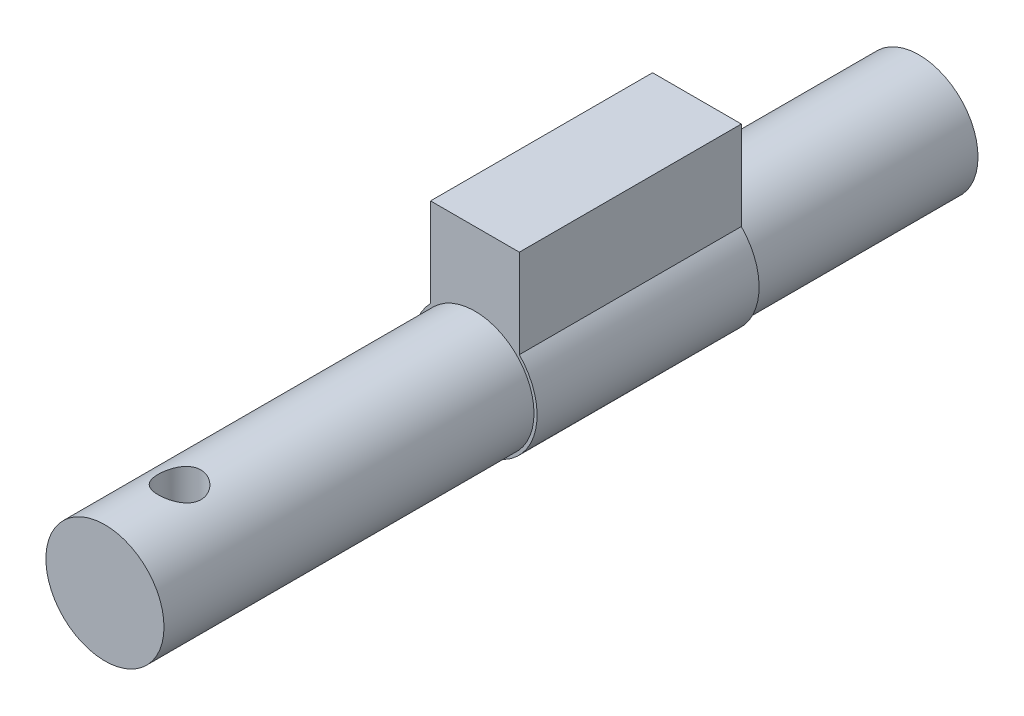
ISO-10303-21;
HEADER;
FILE_DESCRIPTION(('STEP AP214'),'2;1');
FILE_NAME('part.step','',(''),(''),'','','');
FILE_SCHEMA(('AUTOMOTIVE_DESIGN { 1 0 10303 214 1 1 1 1 }'));
ENDSEC;
DATA;
#1=APPLICATION_CONTEXT('core data for automotive mechanical design processes');
#2=APPLICATION_PROTOCOL_DEFINITION('international standard','automotive_design',2000,#1);
#3=PRODUCT_CONTEXT('',#1,'mechanical');
#4=PRODUCT('Part','Part','',(#3));
#5=PRODUCT_RELATED_PRODUCT_CATEGORY('part','',(#4));
#6=PRODUCT_DEFINITION_FORMATION('','',#4);
#7=PRODUCT_DEFINITION_CONTEXT('part definition',#1,'design');
#8=PRODUCT_DEFINITION('design','',#6,#7);
#9=PRODUCT_DEFINITION_SHAPE('','',#8);
#10=(LENGTH_UNIT() NAMED_UNIT(*) SI_UNIT(.MILLI.,.METRE.));
#11=(NAMED_UNIT(*) PLANE_ANGLE_UNIT() SI_UNIT($,.RADIAN.));
#12=(NAMED_UNIT(*) SI_UNIT($,.STERADIAN.) SOLID_ANGLE_UNIT());
#13=UNCERTAINTY_MEASURE_WITH_UNIT(LENGTH_MEASURE(1.E-05),#10,'distance_accuracy_value','');
#14=(GEOMETRIC_REPRESENTATION_CONTEXT(3) GLOBAL_UNCERTAINTY_ASSIGNED_CONTEXT((#13)) GLOBAL_UNIT_ASSIGNED_CONTEXT((#10,
#11,#12)) REPRESENTATION_CONTEXT('',''));
#15=CARTESIAN_POINT('',(0.,0.,0.));
#16=DIRECTION('',(0.,0.,1.));
#17=DIRECTION('',(1.,0.,0.));
#18=AXIS2_PLACEMENT_3D('',#15,#16,#17);
#19=CARTESIAN_POINT('',(-14.383915809038,-0.854852816609851,30.));
#20=DIRECTION('',(0.,0.,1.));
#21=DIRECTION('',(1.,0.,0.));
#22=AXIS2_PLACEMENT_3D('',#19,#20,#21);
#23=PLANE('',#22);
#24=CARTESIAN_POINT('',(-14.383915809038,-0.854852816609851,30.));
#25=DIRECTION('',(0.,0.,1.));
#26=DIRECTION('',(1.,0.,0.));
#27=AXIS2_PLACEMENT_3D('',#24,#25,#26);
#28=CIRCLE('',#27,4.2);
#29=CARTESIAN_POINT('',(-17.383915809038,2.08453487472996,30.));
#30=VERTEX_POINT('',#29);
#31=CARTESIAN_POINT('',(-11.383915809038,2.08453487472996,30.));
#32=VERTEX_POINT('',#31);
#33=EDGE_CURVE('E95',#30,#32,#28,.T.);
#34=ORIENTED_EDGE('',*,*,#33,.T.);
#35=DIRECTION('',(0.,1.,0.));
#36=VECTOR('',#35,1.);
#37=CARTESIAN_POINT('',(-11.383915809038,2.08453487472996,30.));
#38=LINE('',#37,#36);
#39=CARTESIAN_POINT('',(-11.383915809038,8.08453487472996,30.));
#40=VERTEX_POINT('',#39);
#41=EDGE_CURVE('E90',#32,#40,#38,.T.);
#42=ORIENTED_EDGE('',*,*,#41,.T.);
#43=DIRECTION('',(-1.,0.,0.));
#44=VECTOR('',#43,1.);
#45=CARTESIAN_POINT('',(-17.383915809038,8.08453487472996,30.));
#46=LINE('',#45,#44);
#47=CARTESIAN_POINT('',(-17.383915809038,8.08453487472996,30.));
#48=VERTEX_POINT('',#47);
#49=EDGE_CURVE('E93',#40,#48,#46,.T.);
#50=ORIENTED_EDGE('',*,*,#49,.T.);
#51=DIRECTION('',(0.,-1.,0.));
#52=VECTOR('',#51,1.);
#53=CARTESIAN_POINT('',(-17.383915809038,2.08453487472996,30.));
#54=LINE('',#53,#52);
#55=EDGE_CURVE('E59',#48,#30,#54,.T.);
#56=ORIENTED_EDGE('',*,*,#55,.T.);
#57=EDGE_LOOP('',(#34,#42,#50,#56));
#58=FACE_BOUND('',#57,.T.);
#59=CARTESIAN_POINT('',(-14.383915809038,-0.854852816609851,30.));
#60=DIRECTION('',(0.,0.,1.));
#61=DIRECTION('',(1.,0.,0.));
#62=AXIS2_PLACEMENT_3D('',#59,#60,#61);
#63=CIRCLE('',#62,3.99);
#64=CARTESIAN_POINT('',(-10.393915809038,-0.854852816609851,30.));
#65=VERTEX_POINT('',#64);
#66=EDGE_CURVE('E157',#65,#65,#63,.T.);
#67=ORIENTED_EDGE('',*,*,#66,.F.);
#68=EDGE_LOOP('',(#67));
#69=FACE_BOUND('',#68,.T.);
#70=ADVANCED_FACE('F36',(#58,#69),#23,.T.);
#71=CARTESIAN_POINT('',(-14.383915809038,-0.854852816609851,15.));
#72=DIRECTION('',(0.,0.,-1.));
#73=DIRECTION('',(-1.,0.,0.));
#74=AXIS2_PLACEMENT_3D('',#71,#72,#73);
#75=CYLINDRICAL_SURFACE('',#74,3.99);
#76=CARTESIAN_POINT('',(-14.383915809038,-0.854852816609851,15.));
#77=DIRECTION('',(0.,0.,1.));
#78=DIRECTION('',(1.,0.,0.));
#79=AXIS2_PLACEMENT_3D('',#76,#77,#78);
#80=CIRCLE('',#79,3.99);
#81=CARTESIAN_POINT('',(-10.393915809038,-0.854852816609851,15.));
#82=VERTEX_POINT('',#81);
#83=EDGE_CURVE('E11',#82,#82,#80,.T.);
#84=ORIENTED_EDGE('',*,*,#83,.F.);
#85=EDGE_LOOP('',(#84));
#86=FACE_BOUND('',#85,.T.);
#87=CARTESIAN_POINT('',(-14.383915809038,-0.854852816609851,0.));
#88=DIRECTION('',(0.,0.,1.));
#89=DIRECTION('',(1.,0.,0.));
#90=AXIS2_PLACEMENT_3D('',#87,#88,#89);
#91=CIRCLE('',#90,3.99);
#92=CARTESIAN_POINT('',(-10.393915809038,-0.854852816609851,0.));
#93=VERTEX_POINT('',#92);
#94=EDGE_CURVE('E50',#93,#93,#91,.T.);
#95=ORIENTED_EDGE('',*,*,#94,.T.);
#96=EDGE_LOOP('',(#95));
#97=FACE_BOUND('',#96,.T.);
#98=ADVANCED_FACE('F38',(#86,#97),#75,.T.);
#99=CARTESIAN_POINT('',(-14.383915809038,-0.854852816609851,0.));
#100=DIRECTION('',(0.,0.,1.));
#101=DIRECTION('',(1.,0.,0.));
#102=AXIS2_PLACEMENT_3D('',#99,#100,#101);
#103=PLANE('',#102);
#104=ORIENTED_EDGE('',*,*,#94,.F.);
#105=EDGE_LOOP('',(#104));
#106=FACE_BOUND('',#105,.T.);
#107=ADVANCED_FACE('F123',(#106),#103,.F.);
#108=CARTESIAN_POINT('',(-14.383915809038,-0.854852816609851,15.));
#109=DIRECTION('',(0.,0.,1.));
#110=DIRECTION('',(1.,0.,0.));
#111=AXIS2_PLACEMENT_3D('',#108,#109,#110);
#112=PLANE('',#111);
#113=CARTESIAN_POINT('',(-14.383915809038,-0.854852816609851,15.));
#114=DIRECTION('',(0.,0.,1.));
#115=DIRECTION('',(1.,0.,0.));
#116=AXIS2_PLACEMENT_3D('',#113,#114,#115);
#117=CIRCLE('',#116,4.2);
#118=CARTESIAN_POINT('',(-17.383915809038,2.08453487472996,15.));
#119=VERTEX_POINT('',#118);
#120=CARTESIAN_POINT('',(-11.383915809038,2.08453487472996,15.));
#121=VERTEX_POINT('',#120);
#122=EDGE_CURVE('E110',#119,#121,#117,.T.);
#123=ORIENTED_EDGE('',*,*,#122,.F.);
#124=DIRECTION('',(0.,-1.,0.));
#125=VECTOR('',#124,1.);
#126=CARTESIAN_POINT('',(-17.383915809038,2.08453487472996,15.));
#127=LINE('',#126,#125);
#128=CARTESIAN_POINT('',(-17.383915809038,8.08453487472996,15.));
#129=VERTEX_POINT('',#128);
#130=EDGE_CURVE('E82',#129,#119,#127,.T.);
#131=ORIENTED_EDGE('',*,*,#130,.F.);
#132=DIRECTION('',(-1.,0.,0.));
#133=VECTOR('',#132,1.);
#134=CARTESIAN_POINT('',(-17.383915809038,8.08453487472996,15.));
#135=LINE('',#134,#133);
#136=CARTESIAN_POINT('',(-11.383915809038,8.08453487472996,15.));
#137=VERTEX_POINT('',#136);
#138=EDGE_CURVE('E76',#137,#129,#135,.T.);
#139=ORIENTED_EDGE('',*,*,#138,.F.);
#140=DIRECTION('',(0.,1.,0.));
#141=VECTOR('',#140,1.);
#142=CARTESIAN_POINT('',(-11.383915809038,2.08453487472996,15.));
#143=LINE('',#142,#141);
#144=EDGE_CURVE('E100',#121,#137,#143,.T.);
#145=ORIENTED_EDGE('',*,*,#144,.F.);
#146=EDGE_LOOP('',(#123,#131,#139,#145));
#147=FACE_BOUND('',#146,.T.);
#148=ORIENTED_EDGE('',*,*,#83,.T.);
#149=EDGE_LOOP('',(#148));
#150=FACE_BOUND('',#149,.T.);
#151=ADVANCED_FACE('F125',(#147,#150),#112,.F.);
#152=CARTESIAN_POINT('',(-14.383915809038,-0.854852816609851,30.));
#153=DIRECTION('',(0.,0.,-1.));
#154=DIRECTION('',(-1.,0.,0.));
#155=AXIS2_PLACEMENT_3D('',#152,#153,#154);
#156=CYLINDRICAL_SURFACE('',#155,4.2);
#157=ORIENTED_EDGE('',*,*,#122,.T.);
#158=DIRECTION('',(0.,0.,-1.));
#159=VECTOR('',#158,1.);
#160=CARTESIAN_POINT('',(-11.383915809038,2.08453487472996,30.));
#161=LINE('',#160,#159);
#162=EDGE_CURVE('E101',#32,#121,#161,.T.);
#163=ORIENTED_EDGE('',*,*,#162,.F.);
#164=ORIENTED_EDGE('',*,*,#33,.F.);
#165=DIRECTION('',(0.,0.,-1.));
#166=VECTOR('',#165,1.);
#167=CARTESIAN_POINT('',(-17.383915809038,2.08453487472996,30.));
#168=LINE('',#167,#166);
#169=EDGE_CURVE('E106',#30,#119,#168,.T.);
#170=ORIENTED_EDGE('',*,*,#169,.T.);
#171=EDGE_LOOP('',(#157,#163,#164,#170));
#172=FACE_BOUND('',#171,.T.);
#173=ADVANCED_FACE('F130',(#172),#156,.T.);
#174=CARTESIAN_POINT('',(-11.383915809038,2.08453487472996,30.));
#175=DIRECTION('',(-1.,0.,0.));
#176=DIRECTION('',(0.,0.,1.));
#177=AXIS2_PLACEMENT_3D('',#174,#175,#176);
#178=PLANE('',#177);
#179=ORIENTED_EDGE('',*,*,#144,.T.);
#180=DIRECTION('',(0.,0.,-1.));
#181=VECTOR('',#180,1.);
#182=CARTESIAN_POINT('',(-11.383915809038,8.08453487472996,30.));
#183=LINE('',#182,#181);
#184=EDGE_CURVE('E98',#40,#137,#183,.T.);
#185=ORIENTED_EDGE('',*,*,#184,.F.);
#186=ORIENTED_EDGE('',*,*,#41,.F.);
#187=ORIENTED_EDGE('',*,*,#162,.T.);
#188=EDGE_LOOP('',(#179,#185,#186,#187));
#189=FACE_BOUND('',#188,.T.);
#190=ADVANCED_FACE('F99',(#189),#178,.F.);
#191=CARTESIAN_POINT('',(-17.383915809038,8.08453487472996,30.));
#192=DIRECTION('',(0.,-1.,0.));
#193=DIRECTION('',(0.,0.,-1.));
#194=AXIS2_PLACEMENT_3D('',#191,#192,#193);
#195=PLANE('',#194);
#196=ORIENTED_EDGE('',*,*,#138,.T.);
#197=DIRECTION('',(0.,0.,-1.));
#198=VECTOR('',#197,1.);
#199=CARTESIAN_POINT('',(-17.383915809038,8.08453487472996,30.));
#200=LINE('',#199,#198);
#201=EDGE_CURVE('E102',#48,#129,#200,.T.);
#202=ORIENTED_EDGE('',*,*,#201,.F.);
#203=ORIENTED_EDGE('',*,*,#49,.F.);
#204=ORIENTED_EDGE('',*,*,#184,.T.);
#205=EDGE_LOOP('',(#196,#202,#203,#204));
#206=FACE_BOUND('',#205,.T.);
#207=ADVANCED_FACE('F104',(#206),#195,.F.);
#208=CARTESIAN_POINT('',(-17.383915809038,2.08453487472996,30.));
#209=DIRECTION('',(1.,0.,0.));
#210=DIRECTION('',(0.,0.,-1.));
#211=AXIS2_PLACEMENT_3D('',#208,#209,#210);
#212=PLANE('',#211);
#213=ORIENTED_EDGE('',*,*,#130,.T.);
#214=ORIENTED_EDGE('',*,*,#169,.F.);
#215=ORIENTED_EDGE('',*,*,#55,.F.);
#216=ORIENTED_EDGE('',*,*,#201,.T.);
#217=EDGE_LOOP('',(#213,#214,#215,#216));
#218=FACE_BOUND('',#217,.T.);
#219=ADVANCED_FACE('F143',(#218),#212,.F.);
#220=CARTESIAN_POINT('',(-14.383915809038,-0.854852816609851,55.));
#221=DIRECTION('',(0.,0.,-1.));
#222=DIRECTION('',(-1.,0.,0.));
#223=AXIS2_PLACEMENT_3D('',#220,#221,#222);
#224=CYLINDRICAL_SURFACE('',#223,3.99);
#225=CARTESIAN_POINT('',(-14.343915809038,3.13494667709907,51.45));
#226=CARTESIAN_POINT('',(-14.4224532898291,3.1357356961384,51.4500022007073));
#227=CARTESIAN_POINT('',(-14.5009990594725,3.13418193859197,51.4435991552682));
#228=CARTESIAN_POINT('',(-14.6558014529384,3.1266270414262,51.4182303603557));
#229=CARTESIAN_POINT('',(-14.7320583199662,3.12062637606182,51.3992659505529));
#230=CARTESIAN_POINT('',(-14.8800257250441,3.10488303703211,51.3495078593485));
#231=CARTESIAN_POINT('',(-14.9517439984415,3.09514694152154,51.3187349728559));
#232=CARTESIAN_POINT('',(-15.0890154481564,3.07296785653999,51.2463354535928));
#233=CARTESIAN_POINT('',(-15.1545670673235,3.0605241859894,51.2047060893948));
#234=CARTESIAN_POINT('',(-15.2801719506916,3.03373230111177,51.1100988187548));
#235=CARTESIAN_POINT('',(-15.3399550359275,3.01933293521227,51.0567768596756));
#236=CARTESIAN_POINT('',(-15.4499630971895,2.99051881067188,50.9410300090252));
#237=CARTESIAN_POINT('',(-15.5001854749609,2.9761040489142,50.8786026510535));
#238=CARTESIAN_POINT('',(-15.5914296974424,2.94835256724035,50.7436897737135));
#239=CARTESIAN_POINT('',(-15.6320549099615,2.93507339198729,50.6709229254565));
#240=CARTESIAN_POINT('',(-15.7003840882884,2.91188617760576,50.5190568259107));
#241=CARTESIAN_POINT('',(-15.7280923913026,2.90197700720849,50.4399597106503));
#242=CARTESIAN_POINT('',(-15.7687944980029,2.88716110882492,50.2806076617681));
#243=CARTESIAN_POINT('',(-15.7822740991892,2.88208983789386,50.2004926387639));
#244=CARTESIAN_POINT('',(-15.7956523583418,2.87705765301402,50.0389897670541));
#245=CARTESIAN_POINT('',(-15.795555962028,2.87709487804598,49.9576023926685));
#246=CARTESIAN_POINT('',(-15.7821681881439,2.88212879012968,49.8004492760719));
#247=CARTESIAN_POINT('',(-15.7695756279695,2.88686281708297,49.7246140255745));
#248=CARTESIAN_POINT('',(-15.7327108293652,2.90030801570503,49.5762122060762));
#249=CARTESIAN_POINT('',(-15.7084370052509,2.90901972732021,49.503646082309));
#250=CARTESIAN_POINT('',(-15.6485033432221,2.9295801487388,49.3623961060592));
#251=CARTESIAN_POINT('',(-15.6126576143756,2.94147949331113,49.2937988296205));
#252=CARTESIAN_POINT('',(-15.5307195325311,2.96702880051218,49.1633803258417));
#253=CARTESIAN_POINT('',(-15.4846239062875,2.98067932177862,49.1015612725251));
#254=CARTESIAN_POINT('',(-15.3802668150733,3.00914438850116,48.9826010019757));
#255=CARTESIAN_POINT('',(-15.3214462367193,3.02397997400192,48.9259541614249));
#256=CARTESIAN_POINT('',(-15.1949473641956,3.05238727909482,48.823187985452));
#257=CARTESIAN_POINT('',(-15.127268072861,3.06595885611136,48.7770698367793));
#258=CARTESIAN_POINT('',(-14.9839227209679,3.09045187089325,48.6962625173855));
#259=CARTESIAN_POINT('',(-14.9081768856509,3.10134246526629,48.6617048554476));
#260=CARTESIAN_POINT('',(-14.7514612845419,3.11896331928747,48.6059715855892));
#261=CARTESIAN_POINT('',(-14.6704936893382,3.12569529544163,48.5847904563071));
#262=CARTESIAN_POINT('',(-14.5099896895303,3.13392371345328,48.5573586882555));
#263=CARTESIAN_POINT('',(-14.4305842178151,3.13566515233846,48.5504143366579));
#264=CARTESIAN_POINT('',(-14.2717562329452,3.13436046984804,48.5496219575725));
#265=CARTESIAN_POINT('',(-14.1923337257874,3.13131524711065,48.5557714719453));
#266=CARTESIAN_POINT('',(-14.0384512944745,3.12088762619782,48.5804696464599));
#267=CARTESIAN_POINT('',(-13.9639140685191,3.11365120804537,48.5986037444503));
#268=CARTESIAN_POINT('',(-13.8190085619132,3.09563010707354,48.6461939535671));
#269=CARTESIAN_POINT('',(-13.7486408701985,3.08484492440361,48.6756516597446));
#270=CARTESIAN_POINT('',(-13.611614917992,3.06032914290362,48.7460643892823));
#271=CARTESIAN_POINT('',(-13.5451418592438,3.04651687448331,48.7873506071969));
#272=CARTESIAN_POINT('',(-13.4198610010048,3.01746442161701,48.8798697044525));
#273=CARTESIAN_POINT('',(-13.3610560139288,3.00222371676691,48.9311062162027));
#274=CARTESIAN_POINT('',(-13.2493788065556,2.97091186441167,49.0454213013092));
#275=CARTESIAN_POINT('',(-13.1970153775264,2.95484146132678,49.1089984905317));
#276=CARTESIAN_POINT('',(-13.1036238065485,2.92448192731071,49.2443952168277));
#277=CARTESIAN_POINT('',(-13.062596273851,2.91019289214232,49.316215196619));
#278=CARTESIAN_POINT('',(-12.9931663573146,2.8851052595507,49.4663231622732));
#279=CARTESIAN_POINT('',(-12.964765022725,2.87430695223065,49.5446116850374));
#280=CARTESIAN_POINT('',(-12.921731221148,2.85764760888646,49.7053748935142));
#281=CARTESIAN_POINT('',(-12.9070903746362,2.85178356834176,49.7878469993161));
#282=CARTESIAN_POINT('',(-12.8927086806734,2.84601937450353,49.9489107881818));
#283=CARTESIAN_POINT('',(-12.8920685496664,2.84575928926827,50.0274100985924));
#284=CARTESIAN_POINT('',(-12.903430373463,2.85031919201845,50.1833304575203));
#285=CARTESIAN_POINT('',(-12.9154312499441,2.85513874669269,50.2607515974385));
#286=CARTESIAN_POINT('',(-12.9510617984365,2.86903988467011,50.4101084788415));
#287=CARTESIAN_POINT('',(-12.9743533659673,2.87799721436363,50.4821373971475));
#288=CARTESIAN_POINT('',(-13.0316124003084,2.89911870879191,50.6213097265072));
#289=CARTESIAN_POINT('',(-13.0655825344844,2.91128367462955,50.6884519117529));
#290=CARTESIAN_POINT('',(-13.1453038698058,2.93827224772255,50.8197781454533));
#291=CARTESIAN_POINT('',(-13.1915804709187,2.95320199207859,50.8836211920389));
#292=CARTESIAN_POINT('',(-13.2937573971326,2.9837009222385,51.0029156571884));
#293=CARTESIAN_POINT('',(-13.3496608391274,2.99927031389473,51.0583643469411));
#294=CARTESIAN_POINT('',(-13.4730694657728,3.03033868830637,51.1623144551695));
#295=CARTESIAN_POINT('',(-13.5410351222763,3.04578940606906,51.2102859716606));
#296=CARTESIAN_POINT('',(-13.6845889992135,3.07406408222815,51.2941000283288));
#297=CARTESIAN_POINT('',(-13.7601773305853,3.08688800238669,51.3299423919488));
#298=CARTESIAN_POINT('',(-13.9187928326875,3.10877060427405,51.3889180795528));
#299=CARTESIAN_POINT('',(-14.0019539314532,3.11773275061786,51.4117297501649));
#300=CARTESIAN_POINT('',(-14.1713795964492,3.13038619549154,51.4422659966227));
#301=CARTESIAN_POINT('',(-14.2576427016918,3.13407994285203,51.4499975825318));
#302=CARTESIAN_POINT('',(-14.343915809038,3.13494667709907,51.45));
#303=B_SPLINE_CURVE_WITH_KNOTS('',3,(#225,#226,#227,#228,#229,#230,#231,#232,#233,#234,#235,
#236,#237,#238,#239,#240,#241,#242,#243,#244,#245,#246,#247,#248,#249,#250,#251,#252,#253,#254,
#255,#256,#257,#258,#259,#260,#261,#262,#263,#264,#265,#266,#267,#268,#269,#270,#271,#272,#273,
#274,#275,#276,#277,#278,#279,#280,#281,#282,#283,#284,#285,#286,#287,#288,#289,#290,#291,#292,
#293,#294,#295,#296,#297,#298,#299,#300,#301,#302),.UNSPECIFIED.,.T.,.F.,(4,2,2,2,2,2,2,2,2,2,2,
2,2,2,2,2,2,2,2,2,2,2,2,2,2,2,2,2,2,2,2,2,2,2,2,2,2,2,4),(0.,0.235307877010614,
0.470590662457222,0.705460998799103,0.940390484272037,1.1834826817003,1.42664084878519,
1.67855887143213,1.93039224466075,2.17331807859917,2.41615541516849,2.64613685259705,
2.87614951788817,3.11005810917042,3.34404150536603,3.59189222337314,3.83977086427785,
4.09038034783217,4.34088632089382,4.57886423598326,4.81679747891368,5.04690320206006,
5.2770413499389,5.51438730284714,5.75182006361779,6.00239961891231,6.25299263906237,
6.50360647984289,6.75406760888678,6.98839048686,7.2226933778837,7.45037695412738,
7.67811744799134,7.91782885334306,8.15761801676947,8.41022686908196,8.66283939831857,
8.92144439921694,9.17992915742747),.UNSPECIFIED.);
#304=CARTESIAN_POINT('',(-14.343915809038,3.13494667709907,51.45));
#305=VERTEX_POINT('',#304);
#306=EDGE_CURVE('E40',#305,#305,#303,.T.);
#307=ORIENTED_EDGE('',*,*,#306,.T.);
#308=EDGE_LOOP('',(#307));
#309=FACE_BOUND('',#308,.T.);
#310=CARTESIAN_POINT('',(-14.383915809038,-0.854852816609851,55.));
#311=DIRECTION('',(0.,0.,1.));
#312=DIRECTION('',(1.,0.,0.));
#313=AXIS2_PLACEMENT_3D('',#310,#311,#312);
#314=CIRCLE('',#313,3.99);
#315=CARTESIAN_POINT('',(-10.393915809038,-0.854852816609851,55.));
#316=VERTEX_POINT('',#315);
#317=EDGE_CURVE('E113',#316,#316,#314,.T.);
#318=ORIENTED_EDGE('',*,*,#317,.F.);
#319=EDGE_LOOP('',(#318));
#320=FACE_BOUND('',#319,.T.);
#321=ORIENTED_EDGE('',*,*,#66,.T.);
#322=EDGE_LOOP('',(#321));
#323=FACE_BOUND('',#322,.T.);
#324=ADVANCED_FACE('F139',(#309,#320,#323),#224,.T.);
#325=CARTESIAN_POINT('',(-14.383915809038,-0.854852816609851,55.));
#326=DIRECTION('',(0.,0.,1.));
#327=DIRECTION('',(1.,0.,0.));
#328=AXIS2_PLACEMENT_3D('',#325,#326,#327);
#329=PLANE('',#328);
#330=ORIENTED_EDGE('',*,*,#317,.T.);
#331=EDGE_LOOP('',(#330));
#332=FACE_BOUND('',#331,.T.);
#333=ADVANCED_FACE('F174',(#332),#329,.T.);
#334=CARTESIAN_POINT('',(-14.343915809038,0.0845348747299662,50.));
#335=DIRECTION('',(0.,1.,0.));
#336=DIRECTION('',(0.,0.,1.));
#337=AXIS2_PLACEMENT_3D('',#334,#335,#336);
#338=CYLINDRICAL_SURFACE('',#337,1.45);
#339=CARTESIAN_POINT('',(-14.343915809038,0.0845348747299662,50.));
#340=DIRECTION('',(0.,1.,0.));
#341=DIRECTION('',(0.,0.,1.));
#342=AXIS2_PLACEMENT_3D('',#339,#340,#341);
#343=CIRCLE('',#342,1.45);
#344=CARTESIAN_POINT('',(-14.343915809038,0.0845348747299662,51.45));
#345=VERTEX_POINT('',#344);
#346=EDGE_CURVE('E162',#345,#345,#343,.T.);
#347=ORIENTED_EDGE('',*,*,#346,.F.);
#348=EDGE_LOOP('',(#347));
#349=FACE_BOUND('',#348,.T.);
#350=ORIENTED_EDGE('',*,*,#306,.F.);
#351=EDGE_LOOP('',(#350));
#352=FACE_BOUND('',#351,.T.);
#353=ADVANCED_FACE('F171',(#349,#352),#338,.F.);
#354=CARTESIAN_POINT('',(-14.343915809038,0.0845348747299662,50.));
#355=DIRECTION('',(0.,1.,0.));
#356=DIRECTION('',(0.,0.,1.));
#357=AXIS2_PLACEMENT_3D('',#354,#355,#356);
#358=PLANE('',#357);
#359=ORIENTED_EDGE('',*,*,#346,.T.);
#360=EDGE_LOOP('',(#359));
#361=FACE_BOUND('',#360,.T.);
#362=ADVANCED_FACE('F173',(#361),#358,.T.);
#363=CLOSED_SHELL('',(#70,#98,#107,#151,#173,#190,#207,#219,#324,#333,#353,#362));
#364=MANIFOLD_SOLID_BREP('B2',#363);
#365=ADVANCED_BREP_SHAPE_REPRESENTATION('',(#18,#364),#14);
#366=SHAPE_DEFINITION_REPRESENTATION(#9,#365);
ENDSEC;
END-ISO-10303-21;
